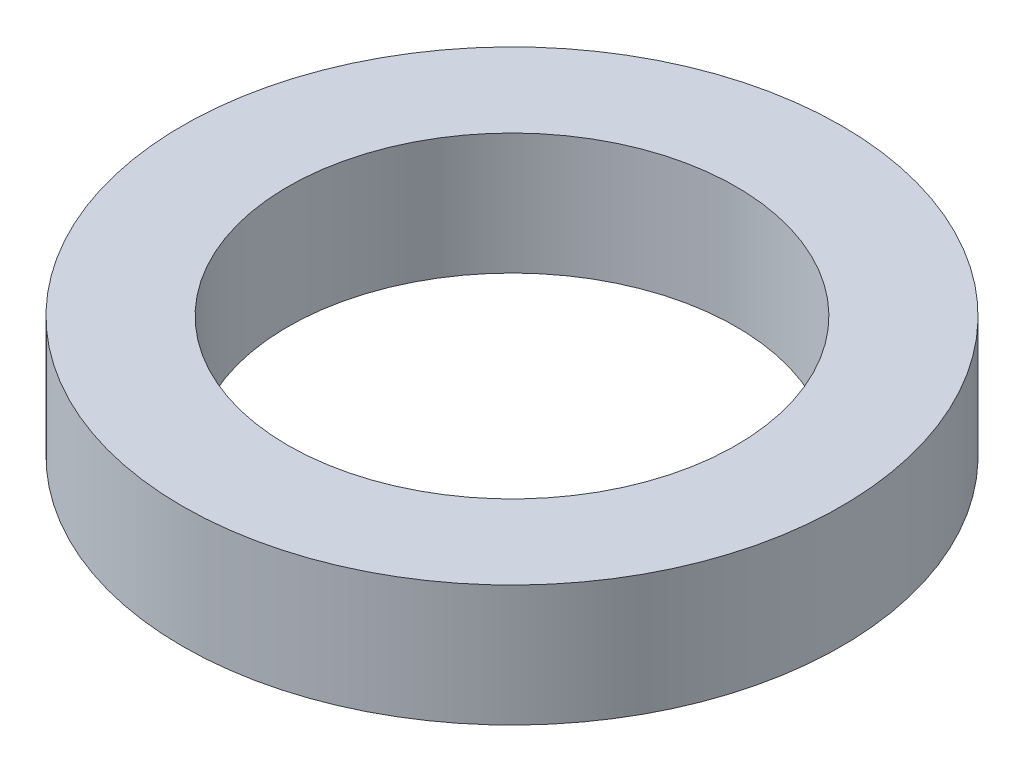
ISO-10303-21;
HEADER;
FILE_DESCRIPTION(('STEP AP214'),'2;1');
FILE_NAME('part.step','',(''),(''),'','','');
FILE_SCHEMA(('AUTOMOTIVE_DESIGN { 1 0 10303 214 1 1 1 1 }'));
ENDSEC;
DATA;
#1=APPLICATION_CONTEXT('core data for automotive mechanical design processes');
#2=APPLICATION_PROTOCOL_DEFINITION('international standard','automotive_design',2000,#1);
#3=PRODUCT_CONTEXT('',#1,'mechanical');
#4=PRODUCT('Part','Part','',(#3));
#5=PRODUCT_RELATED_PRODUCT_CATEGORY('part','',(#4));
#6=PRODUCT_DEFINITION_FORMATION('','',#4);
#7=PRODUCT_DEFINITION_CONTEXT('part definition',#1,'design');
#8=PRODUCT_DEFINITION('design','',#6,#7);
#9=PRODUCT_DEFINITION_SHAPE('','',#8);
#10=(LENGTH_UNIT() NAMED_UNIT(*) SI_UNIT(.MILLI.,.METRE.));
#11=(NAMED_UNIT(*) PLANE_ANGLE_UNIT() SI_UNIT($,.RADIAN.));
#12=(NAMED_UNIT(*) SI_UNIT($,.STERADIAN.) SOLID_ANGLE_UNIT());
#13=UNCERTAINTY_MEASURE_WITH_UNIT(LENGTH_MEASURE(1.E-05),#10,'distance_accuracy_value','');
#14=(GEOMETRIC_REPRESENTATION_CONTEXT(3) GLOBAL_UNCERTAINTY_ASSIGNED_CONTEXT((#13)) GLOBAL_UNIT_ASSIGNED_CONTEXT((#10,
#11,#12)) REPRESENTATION_CONTEXT('',''));
#15=CARTESIAN_POINT('',(0.,0.,0.));
#16=DIRECTION('',(0.,0.,1.));
#17=DIRECTION('',(1.,0.,0.));
#18=AXIS2_PLACEMENT_3D('',#15,#16,#17);
#19=CARTESIAN_POINT('',(0.,23.,0.));
#20=DIRECTION('',(0.,-1.,0.));
#21=DIRECTION('',(0.,0.,-1.));
#22=AXIS2_PLACEMENT_3D('',#19,#20,#21);
#23=CYLINDRICAL_SURFACE('',#22,62.5);
#24=CARTESIAN_POINT('',(0.,23.,0.));
#25=DIRECTION('',(0.,1.,0.));
#26=DIRECTION('',(0.,0.,1.));
#27=AXIS2_PLACEMENT_3D('',#24,#25,#26);
#28=CIRCLE('',#27,62.5);
#29=CARTESIAN_POINT('',(0.,23.,62.5));
#30=VERTEX_POINT('',#29);
#31=EDGE_CURVE('E10',#30,#30,#28,.T.);
#32=ORIENTED_EDGE('',*,*,#31,.F.);
#33=EDGE_LOOP('',(#32));
#34=FACE_BOUND('',#33,.T.);
#35=CARTESIAN_POINT('',(0.,0.,0.));
#36=DIRECTION('',(0.,1.,0.));
#37=DIRECTION('',(0.,0.,1.));
#38=AXIS2_PLACEMENT_3D('',#35,#36,#37);
#39=CIRCLE('',#38,62.5);
#40=CARTESIAN_POINT('',(0.,0.,62.5));
#41=VERTEX_POINT('',#40);
#42=EDGE_CURVE('E37',#41,#41,#39,.T.);
#43=ORIENTED_EDGE('',*,*,#42,.T.);
#44=EDGE_LOOP('',(#43));
#45=FACE_BOUND('',#44,.T.);
#46=ADVANCED_FACE('F40',(#34,#45),#23,.T.);
#47=CARTESIAN_POINT('',(0.,23.,0.));
#48=DIRECTION('',(0.,1.,0.));
#49=DIRECTION('',(0.,0.,1.));
#50=AXIS2_PLACEMENT_3D('',#47,#48,#49);
#51=PLANE('',#50);
#52=CARTESIAN_POINT('',(0.,23.,0.));
#53=DIRECTION('',(0.,1.,0.));
#54=DIRECTION('',(0.,0.,1.));
#55=AXIS2_PLACEMENT_3D('',#52,#53,#54);
#56=CIRCLE('',#55,42.5);
#57=CARTESIAN_POINT('',(0.,23.,42.5));
#58=VERTEX_POINT('',#57);
#59=EDGE_CURVE('E50',#58,#58,#56,.T.);
#60=ORIENTED_EDGE('',*,*,#59,.F.);
#61=EDGE_LOOP('',(#60));
#62=FACE_BOUND('',#61,.T.);
#63=ORIENTED_EDGE('',*,*,#31,.T.);
#64=EDGE_LOOP('',(#63));
#65=FACE_BOUND('',#64,.T.);
#66=ADVANCED_FACE('F59',(#62,#65),#51,.T.);
#67=CARTESIAN_POINT('',(0.,0.,0.));
#68=DIRECTION('',(0.,1.,0.));
#69=DIRECTION('',(0.,0.,1.));
#70=AXIS2_PLACEMENT_3D('',#67,#68,#69);
#71=PLANE('',#70);
#72=CARTESIAN_POINT('',(0.,0.,0.));
#73=DIRECTION('',(0.,1.,0.));
#74=DIRECTION('',(0.,0.,1.));
#75=AXIS2_PLACEMENT_3D('',#72,#73,#74);
#76=CIRCLE('',#75,42.5);
#77=CARTESIAN_POINT('',(0.,0.,42.5));
#78=VERTEX_POINT('',#77);
#79=EDGE_CURVE('E47',#78,#78,#76,.T.);
#80=ORIENTED_EDGE('',*,*,#79,.T.);
#81=EDGE_LOOP('',(#80));
#82=FACE_BOUND('',#81,.T.);
#83=ORIENTED_EDGE('',*,*,#42,.F.);
#84=EDGE_LOOP('',(#83));
#85=FACE_BOUND('',#84,.T.);
#86=ADVANCED_FACE('F58',(#82,#85),#71,.F.);
#87=CARTESIAN_POINT('',(0.,23.,0.));
#88=DIRECTION('',(0.,-1.,0.));
#89=DIRECTION('',(0.,0.,-1.));
#90=AXIS2_PLACEMENT_3D('',#87,#88,#89);
#91=CYLINDRICAL_SURFACE('',#90,42.5);
#92=ORIENTED_EDGE('',*,*,#59,.T.);
#93=EDGE_LOOP('',(#92));
#94=FACE_BOUND('',#93,.T.);
#95=ORIENTED_EDGE('',*,*,#79,.F.);
#96=EDGE_LOOP('',(#95));
#97=FACE_BOUND('',#96,.T.);
#98=ADVANCED_FACE('F54',(#94,#97),#91,.F.);
#99=CLOSED_SHELL('',(#46,#66,#86,#98));
#100=MANIFOLD_SOLID_BREP('B2',#99);
#101=ADVANCED_BREP_SHAPE_REPRESENTATION('',(#18,#100),#14);
#102=SHAPE_DEFINITION_REPRESENTATION(#9,#101);
ENDSEC;
END-ISO-10303-21;
